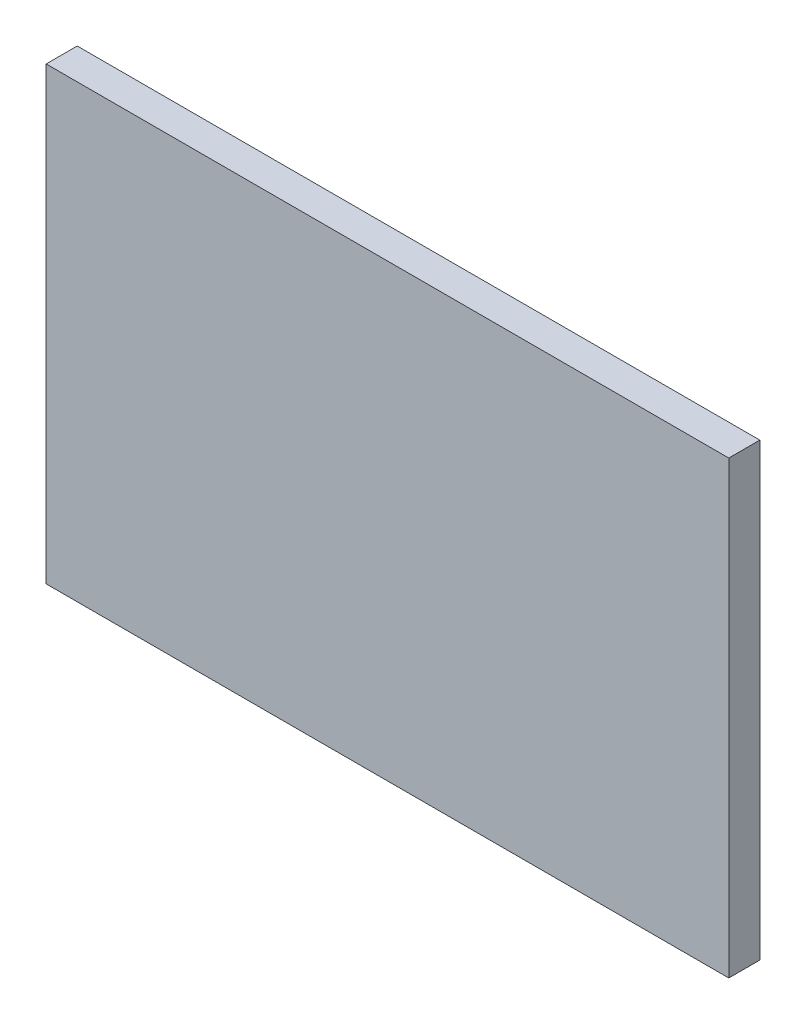
ISO-10303-21;
HEADER;
FILE_DESCRIPTION(('STEP AP214'),'2;1');
FILE_NAME('part.step','',(''),(''),'','','');
FILE_SCHEMA(('AUTOMOTIVE_DESIGN { 1 0 10303 214 1 1 1 1 }'));
ENDSEC;
DATA;
#1=APPLICATION_CONTEXT('core data for automotive mechanical design processes');
#2=APPLICATION_PROTOCOL_DEFINITION('international standard','automotive_design',2000,#1);
#3=PRODUCT_CONTEXT('',#1,'mechanical');
#4=PRODUCT('Part','Part','',(#3));
#5=PRODUCT_RELATED_PRODUCT_CATEGORY('part','',(#4));
#6=PRODUCT_DEFINITION_FORMATION('','',#4);
#7=PRODUCT_DEFINITION_CONTEXT('part definition',#1,'design');
#8=PRODUCT_DEFINITION('design','',#6,#7);
#9=PRODUCT_DEFINITION_SHAPE('','',#8);
#10=(LENGTH_UNIT() NAMED_UNIT(*) SI_UNIT(.MILLI.,.METRE.));
#11=(NAMED_UNIT(*) PLANE_ANGLE_UNIT() SI_UNIT($,.RADIAN.));
#12=(NAMED_UNIT(*) SI_UNIT($,.STERADIAN.) SOLID_ANGLE_UNIT());
#13=UNCERTAINTY_MEASURE_WITH_UNIT(LENGTH_MEASURE(1.E-05),#10,'distance_accuracy_value','');
#14=(GEOMETRIC_REPRESENTATION_CONTEXT(3) GLOBAL_UNCERTAINTY_ASSIGNED_CONTEXT((#13)) GLOBAL_UNIT_ASSIGNED_CONTEXT((#10,
#11,#12)) REPRESENTATION_CONTEXT('',''));
#15=CARTESIAN_POINT('',(0.,0.,0.));
#16=DIRECTION('',(0.,0.,1.));
#17=DIRECTION('',(1.,0.,0.));
#18=AXIS2_PLACEMENT_3D('',#15,#16,#17);
#19=CARTESIAN_POINT('',(-1.092,-0.724,0.1));
#20=DIRECTION('',(0.,0.,-1.));
#21=DIRECTION('',(-1.,0.,0.));
#22=AXIS2_PLACEMENT_3D('',#19,#20,#21);
#23=PLANE('',#22);
#24=DIRECTION('',(0.,1.,0.));
#25=VECTOR('',#24,1.);
#26=CARTESIAN_POINT('',(1.106,-0.724,0.1));
#27=LINE('',#26,#25);
#28=CARTESIAN_POINT('',(1.106,-0.724,0.1));
#29=VERTEX_POINT('',#28);
#30=CARTESIAN_POINT('',(1.106,0.726,0.1));
#31=VERTEX_POINT('',#30);
#32=EDGE_CURVE('E55',#29,#31,#27,.T.);
#33=ORIENTED_EDGE('',*,*,#32,.T.);
#34=DIRECTION('',(1.,0.,0.));
#35=VECTOR('',#34,1.);
#36=CARTESIAN_POINT('',(1.106,0.726,0.1));
#37=LINE('',#36,#35);
#38=CARTESIAN_POINT('',(-1.092,0.726,0.1));
#39=VERTEX_POINT('',#38);
#40=EDGE_CURVE('E57',#31,#39,#37,.F.);
#41=ORIENTED_EDGE('',*,*,#40,.T.);
#42=DIRECTION('',(0.,1.,0.));
#43=VECTOR('',#42,1.);
#44=CARTESIAN_POINT('',(-1.092,0.726,0.1));
#45=LINE('',#44,#43);
#46=CARTESIAN_POINT('',(-1.092,-0.724,0.1));
#47=VERTEX_POINT('',#46);
#48=EDGE_CURVE('E20',#39,#47,#45,.F.);
#49=ORIENTED_EDGE('',*,*,#48,.T.);
#50=DIRECTION('',(1.,0.,0.));
#51=VECTOR('',#50,1.);
#52=CARTESIAN_POINT('',(-1.092,-0.724,0.1));
#53=LINE('',#52,#51);
#54=EDGE_CURVE('E80',#47,#29,#53,.T.);
#55=ORIENTED_EDGE('',*,*,#54,.T.);
#56=EDGE_LOOP('',(#33,#41,#49,#55));
#57=FACE_BOUND('',#56,.T.);
#58=ADVANCED_FACE('F17',(#57),#23,.F.);
#59=CARTESIAN_POINT('',(-1.092,0.726,0.));
#60=DIRECTION('',(1.,0.,0.));
#61=DIRECTION('',(0.,0.,-1.));
#62=AXIS2_PLACEMENT_3D('',#59,#60,#61);
#63=PLANE('',#62);
#64=DIRECTION('',(0.,0.,1.));
#65=VECTOR('',#64,1.);
#66=CARTESIAN_POINT('',(-1.092,-0.724,0.));
#67=LINE('',#66,#65);
#68=CARTESIAN_POINT('',(-1.092,-0.724,0.));
#69=VERTEX_POINT('',#68);
#70=EDGE_CURVE('E68',#69,#47,#67,.T.);
#71=ORIENTED_EDGE('',*,*,#70,.T.);
#72=ORIENTED_EDGE('',*,*,#48,.F.);
#73=DIRECTION('',(0.,0.,-1.));
#74=VECTOR('',#73,1.);
#75=CARTESIAN_POINT('',(-1.092,0.726,0.));
#76=LINE('',#75,#74);
#77=CARTESIAN_POINT('',(-1.092,0.726,0.));
#78=VERTEX_POINT('',#77);
#79=EDGE_CURVE('E63',#39,#78,#76,.T.);
#80=ORIENTED_EDGE('',*,*,#79,.T.);
#81=DIRECTION('',(0.,1.,0.));
#82=VECTOR('',#81,1.);
#83=CARTESIAN_POINT('',(-1.092,-0.724,0.));
#84=LINE('',#83,#82);
#85=EDGE_CURVE('E83',#69,#78,#84,.T.);
#86=ORIENTED_EDGE('',*,*,#85,.F.);
#87=EDGE_LOOP('',(#71,#72,#80,#86));
#88=FACE_BOUND('',#87,.T.);
#89=ADVANCED_FACE('F65',(#88),#63,.F.);
#90=CARTESIAN_POINT('',(1.106,0.726,0.));
#91=DIRECTION('',(0.,-1.,0.));
#92=DIRECTION('',(0.,0.,-1.));
#93=AXIS2_PLACEMENT_3D('',#90,#91,#92);
#94=PLANE('',#93);
#95=ORIENTED_EDGE('',*,*,#79,.F.);
#96=ORIENTED_EDGE('',*,*,#40,.F.);
#97=DIRECTION('',(0.,0.,1.));
#98=VECTOR('',#97,1.);
#99=CARTESIAN_POINT('',(1.106,0.726,0.));
#100=LINE('',#99,#98);
#101=CARTESIAN_POINT('',(1.106,0.726,0.));
#102=VERTEX_POINT('',#101);
#103=EDGE_CURVE('E75',#31,#102,#100,.F.);
#104=ORIENTED_EDGE('',*,*,#103,.T.);
#105=DIRECTION('',(-1.,0.,0.));
#106=VECTOR('',#105,1.);
#107=CARTESIAN_POINT('',(-1.092,0.726,0.));
#108=LINE('',#107,#106);
#109=EDGE_CURVE('E72',#78,#102,#108,.F.);
#110=ORIENTED_EDGE('',*,*,#109,.F.);
#111=EDGE_LOOP('',(#95,#96,#104,#110));
#112=FACE_BOUND('',#111,.T.);
#113=ADVANCED_FACE('F70',(#112),#94,.F.);
#114=CARTESIAN_POINT('',(1.106,-0.724,0.));
#115=DIRECTION('',(-1.,0.,0.));
#116=DIRECTION('',(0.,0.,1.));
#117=AXIS2_PLACEMENT_3D('',#114,#115,#116);
#118=PLANE('',#117);
#119=ORIENTED_EDGE('',*,*,#103,.F.);
#120=ORIENTED_EDGE('',*,*,#32,.F.);
#121=DIRECTION('',(0.,0.,1.));
#122=VECTOR('',#121,1.);
#123=CARTESIAN_POINT('',(1.106,-0.724,0.));
#124=LINE('',#123,#122);
#125=CARTESIAN_POINT('',(1.106,-0.724,0.));
#126=VERTEX_POINT('',#125);
#127=EDGE_CURVE('E35',#29,#126,#124,.F.);
#128=ORIENTED_EDGE('',*,*,#127,.T.);
#129=DIRECTION('',(0.,1.,0.));
#130=VECTOR('',#129,1.);
#131=CARTESIAN_POINT('',(1.106,-0.724,0.));
#132=LINE('',#131,#130);
#133=EDGE_CURVE('E26',#102,#126,#132,.F.);
#134=ORIENTED_EDGE('',*,*,#133,.F.);
#135=EDGE_LOOP('',(#119,#120,#128,#134));
#136=FACE_BOUND('',#135,.T.);
#137=ADVANCED_FACE('F89',(#136),#118,.F.);
#138=CARTESIAN_POINT('',(-1.092,-0.724,0.));
#139=DIRECTION('',(0.,1.,0.));
#140=DIRECTION('',(0.,0.,1.));
#141=AXIS2_PLACEMENT_3D('',#138,#139,#140);
#142=PLANE('',#141);
#143=ORIENTED_EDGE('',*,*,#127,.F.);
#144=ORIENTED_EDGE('',*,*,#54,.F.);
#145=ORIENTED_EDGE('',*,*,#70,.F.);
#146=DIRECTION('',(-1.,0.,0.));
#147=VECTOR('',#146,1.);
#148=CARTESIAN_POINT('',(-1.092,-0.724,0.));
#149=LINE('',#148,#147);
#150=EDGE_CURVE('E11',#126,#69,#149,.T.);
#151=ORIENTED_EDGE('',*,*,#150,.F.);
#152=EDGE_LOOP('',(#143,#144,#145,#151));
#153=FACE_BOUND('',#152,.T.);
#154=ADVANCED_FACE('F91',(#153),#142,.F.);
#155=CARTESIAN_POINT('',(-1.092,-0.724,0.));
#156=DIRECTION('',(0.,0.,-1.));
#157=DIRECTION('',(-1.,0.,0.));
#158=AXIS2_PLACEMENT_3D('',#155,#156,#157);
#159=PLANE('',#158);
#160=ORIENTED_EDGE('',*,*,#133,.T.);
#161=ORIENTED_EDGE('',*,*,#150,.T.);
#162=ORIENTED_EDGE('',*,*,#85,.T.);
#163=ORIENTED_EDGE('',*,*,#109,.T.);
#164=EDGE_LOOP('',(#160,#161,#162,#163));
#165=FACE_BOUND('',#164,.T.);
#166=ADVANCED_FACE('F88',(#165),#159,.T.);
#167=CLOSED_SHELL('',(#58,#89,#113,#137,#154,#166));
#168=MANIFOLD_SOLID_BREP('B1',#167);
#169=ADVANCED_BREP_SHAPE_REPRESENTATION('',(#18,#168),#14);
#170=SHAPE_DEFINITION_REPRESENTATION(#9,#169);
ENDSEC;
END-ISO-10303-21;
